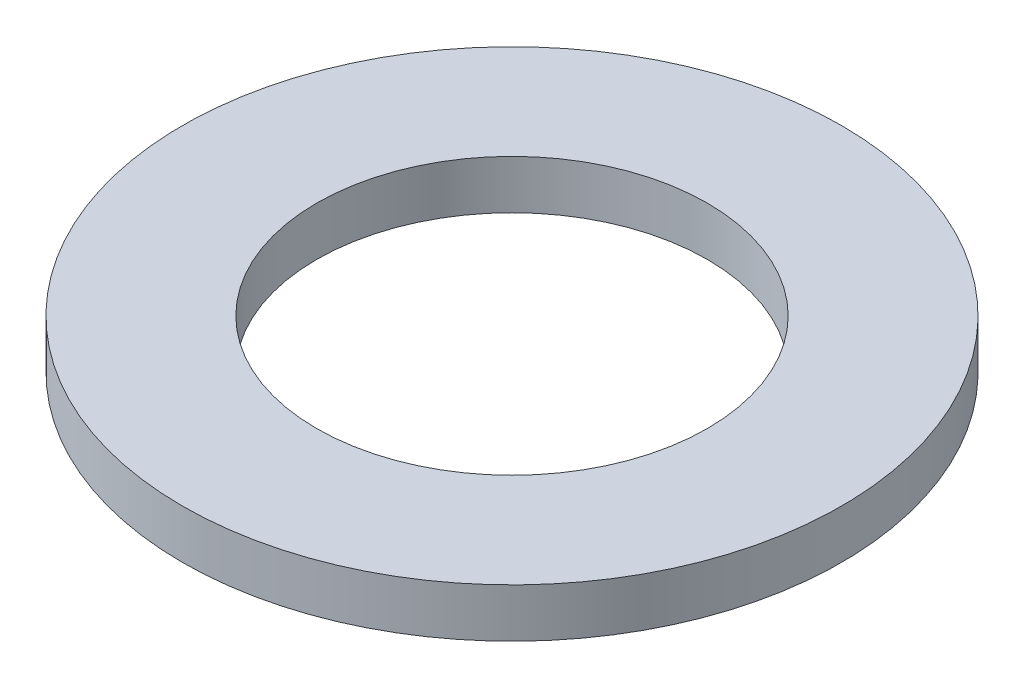
ISO-10303-21;
HEADER;
FILE_DESCRIPTION(('STEP AP214'),'2;1');
FILE_NAME('part.step','',(''),(''),'','','');
FILE_SCHEMA(('AUTOMOTIVE_DESIGN { 1 0 10303 214 1 1 1 1 }'));
ENDSEC;
DATA;
#1=APPLICATION_CONTEXT('core data for automotive mechanical design processes');
#2=APPLICATION_PROTOCOL_DEFINITION('international standard','automotive_design',2000,#1);
#3=PRODUCT_CONTEXT('',#1,'mechanical');
#4=PRODUCT('Part','Part','',(#3));
#5=PRODUCT_RELATED_PRODUCT_CATEGORY('part','',(#4));
#6=PRODUCT_DEFINITION_FORMATION('','',#4);
#7=PRODUCT_DEFINITION_CONTEXT('part definition',#1,'design');
#8=PRODUCT_DEFINITION('design','',#6,#7);
#9=PRODUCT_DEFINITION_SHAPE('','',#8);
#10=(LENGTH_UNIT() NAMED_UNIT(*) SI_UNIT(.MILLI.,.METRE.));
#11=(NAMED_UNIT(*) PLANE_ANGLE_UNIT() SI_UNIT($,.RADIAN.));
#12=(NAMED_UNIT(*) SI_UNIT($,.STERADIAN.) SOLID_ANGLE_UNIT());
#13=UNCERTAINTY_MEASURE_WITH_UNIT(LENGTH_MEASURE(1.E-05),#10,'distance_accuracy_value','');
#14=(GEOMETRIC_REPRESENTATION_CONTEXT(3) GLOBAL_UNCERTAINTY_ASSIGNED_CONTEXT((#13)) GLOBAL_UNIT_ASSIGNED_CONTEXT((#10,
#11,#12)) REPRESENTATION_CONTEXT('',''));
#15=CARTESIAN_POINT('',(0.,0.,0.));
#16=DIRECTION('',(0.,0.,1.));
#17=DIRECTION('',(1.,0.,0.));
#18=AXIS2_PLACEMENT_3D('',#15,#16,#17);
#19=CARTESIAN_POINT('',(0.,10.,0.));
#20=DIRECTION('',(0.,-1.,0.));
#21=DIRECTION('',(0.,0.,-1.));
#22=AXIS2_PLACEMENT_3D('',#19,#20,#21);
#23=CYLINDRICAL_SURFACE('',#22,67.5);
#24=CARTESIAN_POINT('',(0.,10.,0.));
#25=DIRECTION('',(0.,1.,0.));
#26=DIRECTION('',(0.,0.,1.));
#27=AXIS2_PLACEMENT_3D('',#24,#25,#26);
#28=CIRCLE('',#27,67.5);
#29=CARTESIAN_POINT('',(0.,10.,67.5));
#30=VERTEX_POINT('',#29);
#31=EDGE_CURVE('E10',#30,#30,#28,.T.);
#32=ORIENTED_EDGE('',*,*,#31,.F.);
#33=EDGE_LOOP('',(#32));
#34=FACE_BOUND('',#33,.T.);
#35=CARTESIAN_POINT('',(0.,0.,0.));
#36=DIRECTION('',(0.,1.,0.));
#37=DIRECTION('',(0.,0.,1.));
#38=AXIS2_PLACEMENT_3D('',#35,#36,#37);
#39=CIRCLE('',#38,67.5);
#40=CARTESIAN_POINT('',(0.,0.,67.5));
#41=VERTEX_POINT('',#40);
#42=EDGE_CURVE('E37',#41,#41,#39,.T.);
#43=ORIENTED_EDGE('',*,*,#42,.T.);
#44=EDGE_LOOP('',(#43));
#45=FACE_BOUND('',#44,.T.);
#46=ADVANCED_FACE('F40',(#34,#45),#23,.T.);
#47=CARTESIAN_POINT('',(0.,10.,0.));
#48=DIRECTION('',(0.,1.,0.));
#49=DIRECTION('',(0.,0.,1.));
#50=AXIS2_PLACEMENT_3D('',#47,#48,#49);
#51=PLANE('',#50);
#52=CARTESIAN_POINT('',(0.,10.,0.));
#53=DIRECTION('',(0.,1.,0.));
#54=DIRECTION('',(0.,0.,1.));
#55=AXIS2_PLACEMENT_3D('',#52,#53,#54);
#56=CIRCLE('',#55,40.);
#57=CARTESIAN_POINT('',(0.,10.,40.));
#58=VERTEX_POINT('',#57);
#59=EDGE_CURVE('E50',#58,#58,#56,.T.);
#60=ORIENTED_EDGE('',*,*,#59,.F.);
#61=EDGE_LOOP('',(#60));
#62=FACE_BOUND('',#61,.T.);
#63=ORIENTED_EDGE('',*,*,#31,.T.);
#64=EDGE_LOOP('',(#63));
#65=FACE_BOUND('',#64,.T.);
#66=ADVANCED_FACE('F59',(#62,#65),#51,.T.);
#67=CARTESIAN_POINT('',(0.,0.,0.));
#68=DIRECTION('',(0.,1.,0.));
#69=DIRECTION('',(0.,0.,1.));
#70=AXIS2_PLACEMENT_3D('',#67,#68,#69);
#71=PLANE('',#70);
#72=CARTESIAN_POINT('',(0.,0.,0.));
#73=DIRECTION('',(0.,1.,0.));
#74=DIRECTION('',(0.,0.,1.));
#75=AXIS2_PLACEMENT_3D('',#72,#73,#74);
#76=CIRCLE('',#75,40.);
#77=CARTESIAN_POINT('',(0.,0.,40.));
#78=VERTEX_POINT('',#77);
#79=EDGE_CURVE('E47',#78,#78,#76,.T.);
#80=ORIENTED_EDGE('',*,*,#79,.T.);
#81=EDGE_LOOP('',(#80));
#82=FACE_BOUND('',#81,.T.);
#83=ORIENTED_EDGE('',*,*,#42,.F.);
#84=EDGE_LOOP('',(#83));
#85=FACE_BOUND('',#84,.T.);
#86=ADVANCED_FACE('F58',(#82,#85),#71,.F.);
#87=CARTESIAN_POINT('',(0.,10.,0.));
#88=DIRECTION('',(0.,-1.,0.));
#89=DIRECTION('',(0.,0.,-1.));
#90=AXIS2_PLACEMENT_3D('',#87,#88,#89);
#91=CYLINDRICAL_SURFACE('',#90,40.);
#92=ORIENTED_EDGE('',*,*,#59,.T.);
#93=EDGE_LOOP('',(#92));
#94=FACE_BOUND('',#93,.T.);
#95=ORIENTED_EDGE('',*,*,#79,.F.);
#96=EDGE_LOOP('',(#95));
#97=FACE_BOUND('',#96,.T.);
#98=ADVANCED_FACE('F54',(#94,#97),#91,.F.);
#99=CLOSED_SHELL('',(#46,#66,#86,#98));
#100=MANIFOLD_SOLID_BREP('B2',#99);
#101=ADVANCED_BREP_SHAPE_REPRESENTATION('',(#18,#100),#14);
#102=SHAPE_DEFINITION_REPRESENTATION(#9,#101);
ENDSEC;
END-ISO-10303-21;
